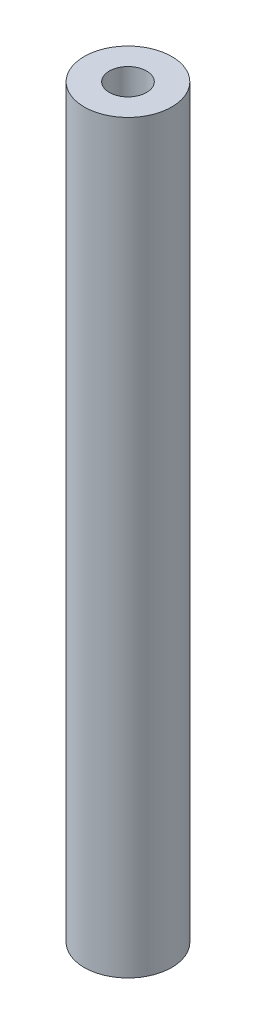
ISO-10303-21;
HEADER;
FILE_DESCRIPTION(('STEP AP214'),'2;1');
FILE_NAME('part.step','',(''),(''),'','','');
FILE_SCHEMA(('AUTOMOTIVE_DESIGN { 1 0 10303 214 1 1 1 1 }'));
ENDSEC;
DATA;
#1=APPLICATION_CONTEXT('core data for automotive mechanical design processes');
#2=APPLICATION_PROTOCOL_DEFINITION('international standard','automotive_design',2000,#1);
#3=PRODUCT_CONTEXT('',#1,'mechanical');
#4=PRODUCT('Part','Part','',(#3));
#5=PRODUCT_RELATED_PRODUCT_CATEGORY('part','',(#4));
#6=PRODUCT_DEFINITION_FORMATION('','',#4);
#7=PRODUCT_DEFINITION_CONTEXT('part definition',#1,'design');
#8=PRODUCT_DEFINITION('design','',#6,#7);
#9=PRODUCT_DEFINITION_SHAPE('','',#8);
#10=(LENGTH_UNIT() NAMED_UNIT(*) SI_UNIT(.MILLI.,.METRE.));
#11=(NAMED_UNIT(*) PLANE_ANGLE_UNIT() SI_UNIT($,.RADIAN.));
#12=(NAMED_UNIT(*) SI_UNIT($,.STERADIAN.) SOLID_ANGLE_UNIT());
#13=UNCERTAINTY_MEASURE_WITH_UNIT(LENGTH_MEASURE(1.E-05),#10,'distance_accuracy_value','');
#14=(GEOMETRIC_REPRESENTATION_CONTEXT(3) GLOBAL_UNCERTAINTY_ASSIGNED_CONTEXT((#13)) GLOBAL_UNIT_ASSIGNED_CONTEXT((#10,
#11,#12)) REPRESENTATION_CONTEXT('',''));
#15=CARTESIAN_POINT('',(0.,0.,0.));
#16=DIRECTION('',(0.,0.,1.));
#17=DIRECTION('',(1.,0.,0.));
#18=AXIS2_PLACEMENT_3D('',#15,#16,#17);
#19=CARTESIAN_POINT('',(0.,17.5,0.));
#20=DIRECTION('',(0.,1.,0.));
#21=DIRECTION('',(0.,0.,1.));
#22=AXIS2_PLACEMENT_3D('',#19,#20,#21);
#23=PLANE('',#22);
#24=CARTESIAN_POINT('',(0.,17.5,0.));
#25=DIRECTION('',(0.,1.,0.));
#26=DIRECTION('',(0.,0.,1.));
#27=AXIS2_PLACEMENT_3D('',#24,#25,#26);
#28=CIRCLE('',#27,2.055);
#29=CARTESIAN_POINT('',(0.,17.5,2.055));
#30=VERTEX_POINT('',#29);
#31=EDGE_CURVE('E10',#30,#30,#28,.T.);
#32=ORIENTED_EDGE('',*,*,#31,.T.);
#33=EDGE_LOOP('',(#32));
#34=FACE_BOUND('',#33,.T.);
#35=CARTESIAN_POINT('',(0.,17.5,0.));
#36=DIRECTION('',(0.,1.,0.));
#37=DIRECTION('',(0.,0.,1.));
#38=AXIS2_PLACEMENT_3D('',#35,#36,#37);
#39=CIRCLE('',#38,0.875);
#40=CARTESIAN_POINT('',(0.,17.5,0.875));
#41=VERTEX_POINT('',#40);
#42=EDGE_CURVE('E56',#41,#41,#39,.T.);
#43=ORIENTED_EDGE('',*,*,#42,.F.);
#44=EDGE_LOOP('',(#43));
#45=FACE_BOUND('',#44,.T.);
#46=ADVANCED_FACE('F43',(#34,#45),#23,.T.);
#47=CARTESIAN_POINT('',(0.,-17.5,0.));
#48=DIRECTION('',(0.,1.,0.));
#49=DIRECTION('',(0.,0.,1.));
#50=AXIS2_PLACEMENT_3D('',#47,#48,#49);
#51=PLANE('',#50);
#52=CARTESIAN_POINT('',(0.,-17.5,0.));
#53=DIRECTION('',(0.,1.,0.));
#54=DIRECTION('',(0.,0.,1.));
#55=AXIS2_PLACEMENT_3D('',#52,#53,#54);
#56=CIRCLE('',#55,2.055);
#57=CARTESIAN_POINT('',(0.,-17.5,2.055));
#58=VERTEX_POINT('',#57);
#59=EDGE_CURVE('E47',#58,#58,#56,.T.);
#60=ORIENTED_EDGE('',*,*,#59,.F.);
#61=EDGE_LOOP('',(#60));
#62=FACE_BOUND('',#61,.T.);
#63=CARTESIAN_POINT('',(0.,-17.5,0.));
#64=DIRECTION('',(0.,1.,0.));
#65=DIRECTION('',(0.,0.,1.));
#66=AXIS2_PLACEMENT_3D('',#63,#64,#65);
#67=CIRCLE('',#66,0.875);
#68=CARTESIAN_POINT('',(0.,-17.5,0.875));
#69=VERTEX_POINT('',#68);
#70=EDGE_CURVE('E58',#69,#69,#67,.T.);
#71=ORIENTED_EDGE('',*,*,#70,.T.);
#72=EDGE_LOOP('',(#71));
#73=FACE_BOUND('',#72,.T.);
#74=ADVANCED_FACE('F70',(#62,#73),#51,.F.);
#75=CARTESIAN_POINT('',(0.,17.5,0.));
#76=DIRECTION('',(0.,-1.,0.));
#77=DIRECTION('',(0.,0.,-1.));
#78=AXIS2_PLACEMENT_3D('',#75,#76,#77);
#79=CYLINDRICAL_SURFACE('',#78,2.055);
#80=ORIENTED_EDGE('',*,*,#31,.F.);
#81=EDGE_LOOP('',(#80));
#82=FACE_BOUND('',#81,.T.);
#83=ORIENTED_EDGE('',*,*,#59,.T.);
#84=EDGE_LOOP('',(#83));
#85=FACE_BOUND('',#84,.T.);
#86=ADVANCED_FACE('F45',(#82,#85),#79,.T.);
#87=CARTESIAN_POINT('',(0.,17.5,0.));
#88=DIRECTION('',(0.,-1.,0.));
#89=DIRECTION('',(0.,0.,-1.));
#90=AXIS2_PLACEMENT_3D('',#87,#88,#89);
#91=CYLINDRICAL_SURFACE('',#90,0.875);
#92=ORIENTED_EDGE('',*,*,#42,.T.);
#93=EDGE_LOOP('',(#92));
#94=FACE_BOUND('',#93,.T.);
#95=ORIENTED_EDGE('',*,*,#70,.F.);
#96=EDGE_LOOP('',(#95));
#97=FACE_BOUND('',#96,.T.);
#98=ADVANCED_FACE('F66',(#94,#97),#91,.F.);
#99=CLOSED_SHELL('',(#46,#74,#86,#98));
#100=MANIFOLD_SOLID_BREP('B2',#99);
#101=ADVANCED_BREP_SHAPE_REPRESENTATION('',(#18,#100),#14);
#102=SHAPE_DEFINITION_REPRESENTATION(#9,#101);
ENDSEC;
END-ISO-10303-21;
